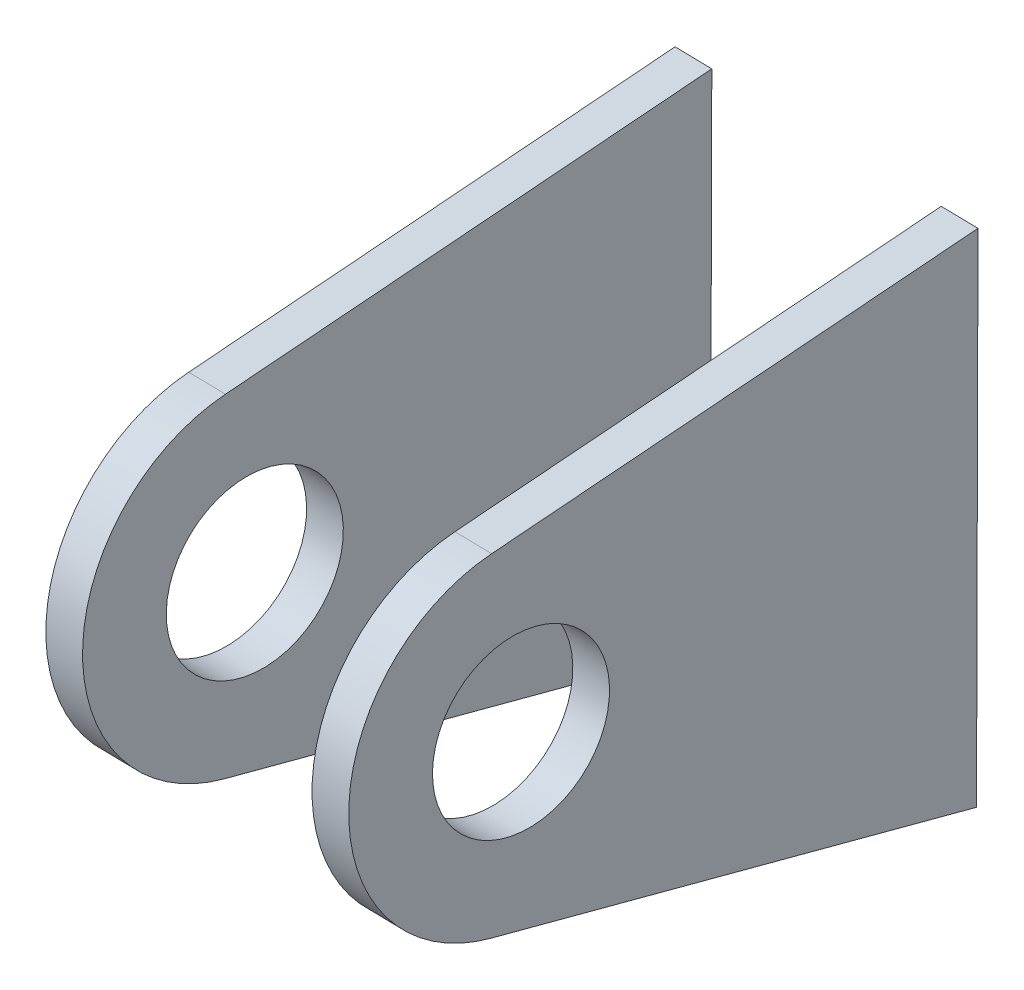
ISO-10303-21;
HEADER;
FILE_DESCRIPTION(('STEP AP214'),'2;1');
FILE_NAME('part.step','',(''),(''),'','','');
FILE_SCHEMA(('AUTOMOTIVE_DESIGN { 1 0 10303 214 1 1 1 1 }'));
ENDSEC;
DATA;
#1=APPLICATION_CONTEXT('core data for automotive mechanical design processes');
#2=APPLICATION_PROTOCOL_DEFINITION('international standard','automotive_design',2000,#1);
#3=PRODUCT_CONTEXT('',#1,'mechanical');
#4=PRODUCT('Part','Part','',(#3));
#5=PRODUCT_RELATED_PRODUCT_CATEGORY('part','',(#4));
#6=PRODUCT_DEFINITION_FORMATION('','',#4);
#7=PRODUCT_DEFINITION_CONTEXT('part definition',#1,'design');
#8=PRODUCT_DEFINITION('design','',#6,#7);
#9=PRODUCT_DEFINITION_SHAPE('','',#8);
#10=(LENGTH_UNIT() NAMED_UNIT(*) SI_UNIT(.MILLI.,.METRE.));
#11=(NAMED_UNIT(*) PLANE_ANGLE_UNIT() SI_UNIT($,.RADIAN.));
#12=(NAMED_UNIT(*) SI_UNIT($,.STERADIAN.) SOLID_ANGLE_UNIT());
#13=UNCERTAINTY_MEASURE_WITH_UNIT(LENGTH_MEASURE(1.E-05),#10,'distance_accuracy_value','');
#14=(GEOMETRIC_REPRESENTATION_CONTEXT(3) GLOBAL_UNCERTAINTY_ASSIGNED_CONTEXT((#13)) GLOBAL_UNIT_ASSIGNED_CONTEXT((#10,
#11,#12)) REPRESENTATION_CONTEXT('',''));
#15=CARTESIAN_POINT('',(0.,0.,0.));
#16=DIRECTION('',(0.,0.,1.));
#17=DIRECTION('',(1.,0.,0.));
#18=AXIS2_PLACEMENT_3D('',#15,#16,#17);
#19=CARTESIAN_POINT('',(6.51438675283903,501.738743890279,118.439007537135));
#20=DIRECTION('',(0.0479979146938385,-0.990006738252662,-0.132600371037822));
#21=DIRECTION('',(0.,0.132753377816507,-0.991149101133784));
#22=AXIS2_PLACEMENT_3D('',#19,#20,#21);
#23=PLANE('',#22);
#24=DIRECTION('',(-0.0523867977596558,-0.135065746400961,0.989450790878273));
#25=VECTOR('',#24,1.);
#26=CARTESIAN_POINT('',(-4.50668931084207,501.29076145788,117.794340848979));
#27=LINE('',#26,#25);
#28=CARTESIAN_POINT('',(-4.50668931084207,501.29076145788,117.794340848979));
#29=VERTEX_POINT('',#28);
#30=CARTESIAN_POINT('',(-5.46007308234029,498.832709120061,135.801288535442));
#31=VERTEX_POINT('',#30);
#32=EDGE_CURVE('E75',#29,#31,#27,.T.);
#33=ORIENTED_EDGE('',*,*,#32,.F.);
#34=DIRECTION('',(-0.997472718226184,-0.0405450658339127,-0.0583461569513517));
#35=VECTOR('',#34,1.);
#36=CARTESIAN_POINT('',(6.51438675283903,501.738743890279,118.439007537135));
#37=LINE('',#36,#35);
#38=CARTESIAN_POINT('',(-6.02683773341877,501.228970777549,117.705421305785));
#39=VERTEX_POINT('',#38);
#40=EDGE_CURVE('E50',#29,#39,#37,.T.);
#41=ORIENTED_EDGE('',*,*,#40,.T.);
#42=DIRECTION('',(-0.0523867977596558,-0.135065746400961,0.989450790878273));
#43=VECTOR('',#42,1.);
#44=CARTESIAN_POINT('',(-6.02683773341877,501.228970777549,117.705421305785));
#45=LINE('',#44,#43);
#46=CARTESIAN_POINT('',(-6.98022150491699,498.77091843973,135.712368992248));
#47=VERTEX_POINT('',#46);
#48=EDGE_CURVE('E101',#39,#47,#45,.T.);
#49=ORIENTED_EDGE('',*,*,#48,.T.);
#50=DIRECTION('',(-0.997472718226184,-0.0405450658339127,-0.0583461569513517));
#51=VECTOR('',#50,1.);
#52=CARTESIAN_POINT('',(5.56100298134082,499.28069155246,136.445955223597));
#53=LINE('',#52,#51);
#54=EDGE_CURVE('E95',#31,#47,#53,.T.);
#55=ORIENTED_EDGE('',*,*,#54,.F.);
#56=EDGE_LOOP('',(#33,#41,#49,#55));
#57=FACE_BOUND('',#56,.T.);
#58=ADVANCED_FACE('F46',(#57),#23,.F.);
#59=CARTESIAN_POINT('',(5.86578973964669,492.994148764555,135.603942867507));
#60=DIRECTION('',(-0.997472718226184,-0.0405450658339127,-0.0583461569513517));
#61=DIRECTION('',(-0.0583941738534486,0.,0.998293604336907));
#62=AXIS2_PLACEMENT_3D('',#59,#60,#61);
#63=CYLINDRICAL_SURFACE('',#62,6.35000000000001);
#64=CARTESIAN_POINT('',(-5.15528632403441,492.546166332157,134.959276179352));
#65=DIRECTION('',(0.997472718226184,0.0405450658339127,0.0583461569513517));
#66=DIRECTION('',(0.0583941738534486,0.,-0.998293604336907));
#67=AXIS2_PLACEMENT_3D('',#64,#65,#66);
#68=CIRCLE('',#67,6.35000000000001);
#69=CARTESIAN_POINT('',(-4.98265556583725,486.345408906373,136.316960225041));
#70=VERTEX_POINT('',#69);
#71=EDGE_CURVE('E72',#31,#70,#68,.T.);
#72=ORIENTED_EDGE('',*,*,#71,.F.);
#73=ORIENTED_EDGE('',*,*,#54,.T.);
#74=CARTESIAN_POINT('',(-6.67543474661111,492.484375651826,134.870356636158));
#75=DIRECTION('',(0.997472718226184,0.0405450658339127,0.0583461569513517));
#76=DIRECTION('',(0.0583941738534486,0.,-0.998293604336907));
#77=AXIS2_PLACEMENT_3D('',#74,#75,#76);
#78=CIRCLE('',#77,6.35000000000001);
#79=CARTESIAN_POINT('',(-6.50280398841395,486.283618226042,136.228040681847));
#80=VERTEX_POINT('',#79);
#81=EDGE_CURVE('E99',#47,#80,#78,.T.);
#82=ORIENTED_EDGE('',*,*,#81,.T.);
#83=DIRECTION('',(-0.997472718226184,-0.0405450658339127,-0.0583461569513517));
#84=VECTOR('',#83,1.);
#85=CARTESIAN_POINT('',(6.03842049784386,486.793391338772,136.961626913196));
#86=LINE('',#85,#84);
#87=EDGE_CURVE('E109',#70,#80,#86,.T.);
#88=ORIENTED_EDGE('',*,*,#87,.F.);
#89=EDGE_LOOP('',(#72,#73,#82,#88));
#90=FACE_BOUND('',#89,.T.);
#91=ADVANCED_FACE('F97',(#90),#63,.T.);
#92=CARTESIAN_POINT('',(7.23306647723408,482.941005713962,119.215273122181));
#93=DIRECTION('',(-0.0271859461727815,0.976497232406799,-0.213808511132164));
#94=DIRECTION('',(0.,0.213887565289352,0.976858285225955));
#95=AXIS2_PLACEMENT_3D('',#92,#93,#94);
#96=PLANE('',#95);
#97=DIRECTION('',(0.0656437409442719,-0.211681961296625,-0.975131604726488));
#98=VECTOR('',#97,1.);
#99=CARTESIAN_POINT('',(-3.78800958644703,482.493023281564,118.570606434025));
#100=LINE('',#99,#98);
#101=CARTESIAN_POINT('',(-3.78800958644702,482.493023281564,118.570606434025));
#102=VERTEX_POINT('',#101);
#103=EDGE_CURVE('E56',#70,#102,#100,.T.);
#104=ORIENTED_EDGE('',*,*,#103,.F.);
#105=ORIENTED_EDGE('',*,*,#87,.T.);
#106=DIRECTION('',(0.0656437409442719,-0.211681961296625,-0.975131604726488));
#107=VECTOR('',#106,1.);
#108=CARTESIAN_POINT('',(-5.30815800902373,482.431232601233,118.481686890831));
#109=LINE('',#108,#107);
#110=CARTESIAN_POINT('',(-5.30815800902373,482.431232601233,118.481686890831));
#111=VERTEX_POINT('',#110);
#112=EDGE_CURVE('E108',#80,#111,#109,.T.);
#113=ORIENTED_EDGE('',*,*,#112,.T.);
#114=DIRECTION('',(-0.997472718226184,-0.0405450658339127,-0.0583461569513517));
#115=VECTOR('',#114,1.);
#116=CARTESIAN_POINT('',(7.23306647723408,482.941005713962,119.215273122181));
#117=LINE('',#116,#115);
#118=EDGE_CURVE('E82',#102,#111,#117,.T.);
#119=ORIENTED_EDGE('',*,*,#118,.F.);
#120=EDGE_LOOP('',(#104,#105,#113,#119));
#121=FACE_BOUND('',#120,.T.);
#122=ADVANCED_FACE('F126',(#121),#96,.F.);
#123=CARTESIAN_POINT('',(6.51438675283903,501.738743890279,118.439007537135));
#124=DIRECTION('',(-0.0599256750075895,0.0388990717535112,0.997444622869661));
#125=DIRECTION('',(0.998200115924467,0.,0.059971064425944));
#126=AXIS2_PLACEMENT_3D('',#123,#124,#125);
#127=PLANE('',#126);
#128=DIRECTION('',(-0.0381718465541402,0.9984202320933,-0.0412304532767746));
#129=VECTOR('',#128,1.);
#130=CARTESIAN_POINT('',(-4.50668931084207,501.29076145788,117.794340848979));
#131=LINE('',#130,#129);
#132=EDGE_CURVE('E12',#102,#29,#131,.T.);
#133=ORIENTED_EDGE('',*,*,#132,.F.);
#134=ORIENTED_EDGE('',*,*,#118,.T.);
#135=DIRECTION('',(-0.0381718465541402,0.9984202320933,-0.0412304532767746));
#136=VECTOR('',#135,1.);
#137=CARTESIAN_POINT('',(-6.02683773341877,501.228970777549,117.705421305785));
#138=LINE('',#137,#136);
#139=EDGE_CURVE('E122',#111,#39,#138,.T.);
#140=ORIENTED_EDGE('',*,*,#139,.T.);
#141=ORIENTED_EDGE('',*,*,#40,.F.);
#142=EDGE_LOOP('',(#133,#134,#140,#141));
#143=FACE_BOUND('',#142,.T.);
#144=ADVANCED_FACE('F127',(#143),#127,.F.);
#145=CARTESIAN_POINT('',(5.86578973964669,492.994148764555,135.603942867507));
#146=DIRECTION('',(-0.997472718226184,-0.0405450658339127,-0.0583461569513517));
#147=DIRECTION('',(-0.0583941738534486,0.,0.998293604336907));
#148=AXIS2_PLACEMENT_3D('',#145,#146,#147);
#149=CYLINDRICAL_SURFACE('',#148,3.26390000000001);
#150=CARTESIAN_POINT('',(-6.67543474661111,492.484375651826,134.870356636158));
#151=DIRECTION('',(0.997472718226184,0.0405450658339127,0.0583461569513517));
#152=DIRECTION('',(0.0583941738534486,0.,-0.998293604336907));
#153=AXIS2_PLACEMENT_3D('',#150,#151,#152);
#154=CIRCLE('',#153,3.26390000000001);
#155=CARTESIAN_POINT('',(-6.48484200257084,492.484375651826,131.612026140963));
#156=VERTEX_POINT('',#155);
#157=EDGE_CURVE('E114',#156,#156,#154,.T.);
#158=ORIENTED_EDGE('',*,*,#157,.F.);
#159=EDGE_LOOP('',(#158));
#160=FACE_BOUND('',#159,.T.);
#161=CARTESIAN_POINT('',(-5.15528632403441,492.546166332157,134.959276179352));
#162=DIRECTION('',(0.997472718226184,0.0405450658339127,0.0583461569513517));
#163=DIRECTION('',(0.0583941738534486,0.,-0.998293604336907));
#164=AXIS2_PLACEMENT_3D('',#161,#162,#163);
#165=CIRCLE('',#164,3.26390000000001);
#166=CARTESIAN_POINT('',(-4.96469357999414,492.546166332157,131.700945684156));
#167=VERTEX_POINT('',#166);
#168=EDGE_CURVE('E116',#167,#167,#165,.T.);
#169=ORIENTED_EDGE('',*,*,#168,.T.);
#170=EDGE_LOOP('',(#169));
#171=FACE_BOUND('',#170,.T.);
#172=ADVANCED_FACE('F48',(#160,#171),#149,.F.);
#173=CARTESIAN_POINT('',(-6.67543474661111,492.484375651826,134.870356636158));
#174=DIRECTION('',(0.997472718226184,0.0405450658339127,0.0583461569513517));
#175=DIRECTION('',(0.0583941738534486,0.,-0.998293604336907));
#176=AXIS2_PLACEMENT_3D('',#173,#174,#175);
#177=PLANE('',#176);
#178=ORIENTED_EDGE('',*,*,#48,.F.);
#179=ORIENTED_EDGE('',*,*,#139,.F.);
#180=ORIENTED_EDGE('',*,*,#112,.F.);
#181=ORIENTED_EDGE('',*,*,#81,.F.);
#182=EDGE_LOOP('',(#178,#179,#180,#181));
#183=FACE_BOUND('',#182,.T.);
#184=ORIENTED_EDGE('',*,*,#157,.T.);
#185=EDGE_LOOP('',(#184));
#186=FACE_BOUND('',#185,.T.);
#187=ADVANCED_FACE('F105',(#183,#186),#177,.F.);
#188=CARTESIAN_POINT('',(-5.15528632403441,492.546166332157,134.959276179352));
#189=DIRECTION('',(0.997472718226184,0.0405450658339127,0.0583461569513517));
#190=DIRECTION('',(0.0583941738534486,0.,-0.998293604336907));
#191=AXIS2_PLACEMENT_3D('',#188,#189,#190);
#192=PLANE('',#191);
#193=ORIENTED_EDGE('',*,*,#168,.F.);
#194=EDGE_LOOP('',(#193));
#195=FACE_BOUND('',#194,.T.);
#196=ORIENTED_EDGE('',*,*,#32,.T.);
#197=ORIENTED_EDGE('',*,*,#71,.T.);
#198=ORIENTED_EDGE('',*,*,#103,.T.);
#199=ORIENTED_EDGE('',*,*,#132,.T.);
#200=EDGE_LOOP('',(#196,#197,#198,#199));
#201=FACE_BOUND('',#200,.T.);
#202=ADVANCED_FACE('F167',(#195,#201),#192,.T.);
#203=CLOSED_SHELL('',(#58,#91,#122,#144,#172,#187,#202));
#204=MANIFOLD_SOLID_BREP('B2',#203);
#205=CARTESIAN_POINT('',(6.51438675283903,501.738743890279,118.439007537135));
#206=DIRECTION('',(-0.0599256750075895,0.0388990717535112,0.997444622869661));
#207=DIRECTION('',(0.998200115924467,0.,0.059971064425944));
#208=AXIS2_PLACEMENT_3D('',#205,#206,#207);
#209=PLANE('',#208);
#210=DIRECTION('',(-0.997472718226184,-0.0405450658339127,-0.0583461569513517));
#211=VECTOR('',#210,1.);
#212=CARTESIAN_POINT('',(7.23306647723408,482.941005713962,119.215273122181));
#213=LINE('',#212,#211);
#214=CARTESIAN_POINT('',(7.23306647723408,482.941005713962,119.215273122181));
#215=VERTEX_POINT('',#214);
#216=CARTESIAN_POINT('',(5.71291805465737,482.879215033632,119.126353578987));
#217=VERTEX_POINT('',#216);
#218=EDGE_CURVE('E263',#215,#217,#213,.T.);
#219=ORIENTED_EDGE('',*,*,#218,.T.);
#220=DIRECTION('',(-0.0381718465541402,0.9984202320933,-0.0412304532767746));
#221=VECTOR('',#220,1.);
#222=CARTESIAN_POINT('',(4.99423833026233,501.676953209948,118.350087993941));
#223=LINE('',#222,#221);
#224=CARTESIAN_POINT('',(4.99423833026233,501.676953209948,118.350087993941));
#225=VERTEX_POINT('',#224);
#226=EDGE_CURVE('E256',#217,#225,#223,.T.);
#227=ORIENTED_EDGE('',*,*,#226,.T.);
#228=DIRECTION('',(-0.997472718226184,-0.0405450658339127,-0.0583461569513517));
#229=VECTOR('',#228,1.);
#230=CARTESIAN_POINT('',(6.51438675283903,501.738743890279,118.439007537135));
#231=LINE('',#230,#229);
#232=CARTESIAN_POINT('',(6.51438675283903,501.738743890279,118.439007537135));
#233=VERTEX_POINT('',#232);
#234=EDGE_CURVE('E242',#233,#225,#231,.T.);
#235=ORIENTED_EDGE('',*,*,#234,.F.);
#236=DIRECTION('',(-0.0381718465541402,0.9984202320933,-0.0412304532767746));
#237=VECTOR('',#236,1.);
#238=CARTESIAN_POINT('',(6.51438675283903,501.738743890279,118.439007537135));
#239=LINE('',#238,#237);
#240=EDGE_CURVE('E213',#215,#233,#239,.T.);
#241=ORIENTED_EDGE('',*,*,#240,.F.);
#242=EDGE_LOOP('',(#219,#227,#235,#241));
#243=FACE_BOUND('',#242,.T.);
#244=ADVANCED_FACE('F190',(#243),#209,.F.);
#245=CARTESIAN_POINT('',(7.23306647723408,482.941005713962,119.215273122181));
#246=DIRECTION('',(-0.0271859461727815,0.976497232406799,-0.213808511132164));
#247=DIRECTION('',(0.,0.213887565289352,0.976858285225955));
#248=AXIS2_PLACEMENT_3D('',#245,#246,#247);
#249=PLANE('',#248);
#250=DIRECTION('',(-0.997472718226184,-0.0405450658339127,-0.0583461569513517));
#251=VECTOR('',#250,1.);
#252=CARTESIAN_POINT('',(6.03842049784386,486.793391338772,136.961626913196));
#253=LINE('',#252,#251);
#254=CARTESIAN_POINT('',(6.03842049784386,486.793391338772,136.961626913196));
#255=VERTEX_POINT('',#254);
#256=CARTESIAN_POINT('',(4.51827207526715,486.731600658441,136.872707370003));
#257=VERTEX_POINT('',#256);
#258=EDGE_CURVE('E198',#255,#257,#253,.T.);
#259=ORIENTED_EDGE('',*,*,#258,.T.);
#260=DIRECTION('',(0.0656437409442719,-0.211681961296625,-0.975131604726488));
#261=VECTOR('',#260,1.);
#262=CARTESIAN_POINT('',(5.71291805465737,482.879215033632,119.126353578987));
#263=LINE('',#262,#261);
#264=EDGE_CURVE('E233',#257,#217,#263,.T.);
#265=ORIENTED_EDGE('',*,*,#264,.T.);
#266=ORIENTED_EDGE('',*,*,#218,.F.);
#267=DIRECTION('',(0.0656437409442719,-0.211681961296625,-0.975131604726488));
#268=VECTOR('',#267,1.);
#269=CARTESIAN_POINT('',(7.23306647723408,482.941005713962,119.215273122181));
#270=LINE('',#269,#268);
#271=EDGE_CURVE('E248',#255,#215,#270,.T.);
#272=ORIENTED_EDGE('',*,*,#271,.F.);
#273=EDGE_LOOP('',(#259,#265,#266,#272));
#274=FACE_BOUND('',#273,.T.);
#275=ADVANCED_FACE('F266',(#274),#249,.F.);
#276=CARTESIAN_POINT('',(5.86578973964669,492.994148764555,135.603942867507));
#277=DIRECTION('',(-0.997472718226184,-0.0405450658339127,-0.0583461569513517));
#278=DIRECTION('',(-0.0583941738534486,0.,0.998293604336907));
#279=AXIS2_PLACEMENT_3D('',#276,#277,#278);
#280=CYLINDRICAL_SURFACE('',#279,6.35000000000001);
#281=DIRECTION('',(-0.997472718226184,-0.0405450658339127,-0.0583461569513517));
#282=VECTOR('',#281,1.);
#283=CARTESIAN_POINT('',(5.56100298134082,499.28069155246,136.445955223597));
#284=LINE('',#283,#282);
#285=CARTESIAN_POINT('',(5.56100298134082,499.28069155246,136.445955223597));
#286=VERTEX_POINT('',#285);
#287=CARTESIAN_POINT('',(4.04085455876412,499.218900872129,136.357035680403));
#288=VERTEX_POINT('',#287);
#289=EDGE_CURVE('E44',#286,#288,#284,.T.);
#290=ORIENTED_EDGE('',*,*,#289,.T.);
#291=CARTESIAN_POINT('',(4.34564131706999,492.932358084225,135.515023324313));
#292=DIRECTION('',(0.997472718226184,0.0405450658339127,0.0583461569513517));
#293=DIRECTION('',(0.0583941738534486,0.,-0.998293604336907));
#294=AXIS2_PLACEMENT_3D('',#291,#292,#293);
#295=CIRCLE('',#294,6.35000000000001);
#296=EDGE_CURVE('E230',#288,#257,#295,.T.);
#297=ORIENTED_EDGE('',*,*,#296,.T.);
#298=ORIENTED_EDGE('',*,*,#258,.F.);
#299=CARTESIAN_POINT('',(5.86578973964669,492.994148764555,135.603942867507));
#300=DIRECTION('',(0.997472718226184,0.0405450658339127,0.0583461569513517));
#301=DIRECTION('',(0.0583941738534486,0.,-0.998293604336907));
#302=AXIS2_PLACEMENT_3D('',#299,#300,#301);
#303=CIRCLE('',#302,6.35000000000001);
#304=EDGE_CURVE('E246',#286,#255,#303,.T.);
#305=ORIENTED_EDGE('',*,*,#304,.F.);
#306=EDGE_LOOP('',(#290,#297,#298,#305));
#307=FACE_BOUND('',#306,.T.);
#308=ADVANCED_FACE('F245',(#307),#280,.T.);
#309=CARTESIAN_POINT('',(6.51438675283903,501.738743890279,118.439007537135));
#310=DIRECTION('',(0.0479979146938385,-0.990006738252662,-0.132600371037822));
#311=DIRECTION('',(0.,0.132753377816507,-0.991149101133784));
#312=AXIS2_PLACEMENT_3D('',#309,#310,#311);
#313=PLANE('',#312);
#314=ORIENTED_EDGE('',*,*,#234,.T.);
#315=DIRECTION('',(-0.0523867977596558,-0.135065746400961,0.989450790878273));
#316=VECTOR('',#315,1.);
#317=CARTESIAN_POINT('',(4.99423833026233,501.676953209948,118.350087993941));
#318=LINE('',#317,#316);
#319=EDGE_CURVE('E205',#225,#288,#318,.T.);
#320=ORIENTED_EDGE('',*,*,#319,.T.);
#321=ORIENTED_EDGE('',*,*,#289,.F.);
#322=DIRECTION('',(-0.0523867977596558,-0.135065746400961,0.989450790878273));
#323=VECTOR('',#322,1.);
#324=CARTESIAN_POINT('',(6.51438675283903,501.738743890279,118.439007537135));
#325=LINE('',#324,#323);
#326=EDGE_CURVE('E249',#233,#286,#325,.T.);
#327=ORIENTED_EDGE('',*,*,#326,.F.);
#328=EDGE_LOOP('',(#314,#320,#321,#327));
#329=FACE_BOUND('',#328,.T.);
#330=ADVANCED_FACE('F192',(#329),#313,.F.);
#331=CARTESIAN_POINT('',(5.86578973964669,492.994148764555,135.603942867507));
#332=DIRECTION('',(0.997472718226184,0.0405450658339127,0.0583461569513517));
#333=DIRECTION('',(0.0583941738534486,0.,-0.998293604336907));
#334=AXIS2_PLACEMENT_3D('',#331,#332,#333);
#335=PLANE('',#334);
#336=ORIENTED_EDGE('',*,*,#326,.T.);
#337=ORIENTED_EDGE('',*,*,#304,.T.);
#338=ORIENTED_EDGE('',*,*,#271,.T.);
#339=ORIENTED_EDGE('',*,*,#240,.T.);
#340=EDGE_LOOP('',(#336,#337,#338,#339));
#341=FACE_BOUND('',#340,.T.);
#342=CARTESIAN_POINT('',(5.86578973964669,492.994148764555,135.603942867507));
#343=DIRECTION('',(0.997472718226184,0.0405450658339127,0.0583461569513517));
#344=DIRECTION('',(0.0583941738534486,0.,-0.998293604336907));
#345=AXIS2_PLACEMENT_3D('',#342,#343,#344);
#346=CIRCLE('',#345,3.26390000000001);
#347=CARTESIAN_POINT('',(6.05638248368697,492.994148764555,132.345612372312));
#348=VERTEX_POINT('',#347);
#349=EDGE_CURVE('E253',#348,#348,#346,.T.);
#350=ORIENTED_EDGE('',*,*,#349,.F.);
#351=EDGE_LOOP('',(#350));
#352=FACE_BOUND('',#351,.T.);
#353=ADVANCED_FACE('F251',(#341,#352),#335,.T.);
#354=CARTESIAN_POINT('',(5.86578973964669,492.994148764555,135.603942867507));
#355=DIRECTION('',(-0.997472718226184,-0.0405450658339127,-0.0583461569513517));
#356=DIRECTION('',(-0.0583941738534486,0.,0.998293604336907));
#357=AXIS2_PLACEMENT_3D('',#354,#355,#356);
#358=CYLINDRICAL_SURFACE('',#357,3.26390000000001);
#359=CARTESIAN_POINT('',(4.34564131706999,492.932358084225,135.515023324313));
#360=DIRECTION('',(0.997472718226184,0.0405450658339127,0.0583461569513517));
#361=DIRECTION('',(0.0583941738534486,0.,-0.998293604336907));
#362=AXIS2_PLACEMENT_3D('',#359,#360,#361);
#363=CIRCLE('',#362,3.26390000000001);
#364=CARTESIAN_POINT('',(4.53623406111026,492.932358084225,132.256692829118));
#365=VERTEX_POINT('',#364);
#366=EDGE_CURVE('E243',#365,#365,#363,.T.);
#367=ORIENTED_EDGE('',*,*,#366,.F.);
#368=EDGE_LOOP('',(#367));
#369=FACE_BOUND('',#368,.T.);
#370=ORIENTED_EDGE('',*,*,#349,.T.);
#371=EDGE_LOOP('',(#370));
#372=FACE_BOUND('',#371,.T.);
#373=ADVANCED_FACE('F275',(#369,#372),#358,.F.);
#374=CARTESIAN_POINT('',(4.34564131706999,492.932358084225,135.515023324313));
#375=DIRECTION('',(0.997472718226184,0.0405450658339127,0.0583461569513517));
#376=DIRECTION('',(0.0583941738534486,0.,-0.998293604336907));
#377=AXIS2_PLACEMENT_3D('',#374,#375,#376);
#378=PLANE('',#377);
#379=ORIENTED_EDGE('',*,*,#366,.T.);
#380=EDGE_LOOP('',(#379));
#381=FACE_BOUND('',#380,.T.);
#382=ORIENTED_EDGE('',*,*,#319,.F.);
#383=ORIENTED_EDGE('',*,*,#226,.F.);
#384=ORIENTED_EDGE('',*,*,#264,.F.);
#385=ORIENTED_EDGE('',*,*,#296,.F.);
#386=EDGE_LOOP('',(#382,#383,#384,#385));
#387=FACE_BOUND('',#386,.T.);
#388=ADVANCED_FACE('F231',(#381,#387),#378,.F.);
#389=CLOSED_SHELL('',(#244,#275,#308,#330,#353,#373,#388));
#390=MANIFOLD_SOLID_BREP('B6',#389);
#391=ADVANCED_BREP_SHAPE_REPRESENTATION('',(#18,#204,#390),#14);
#392=SHAPE_DEFINITION_REPRESENTATION(#9,#391);
ENDSEC;
END-ISO-10303-21;
